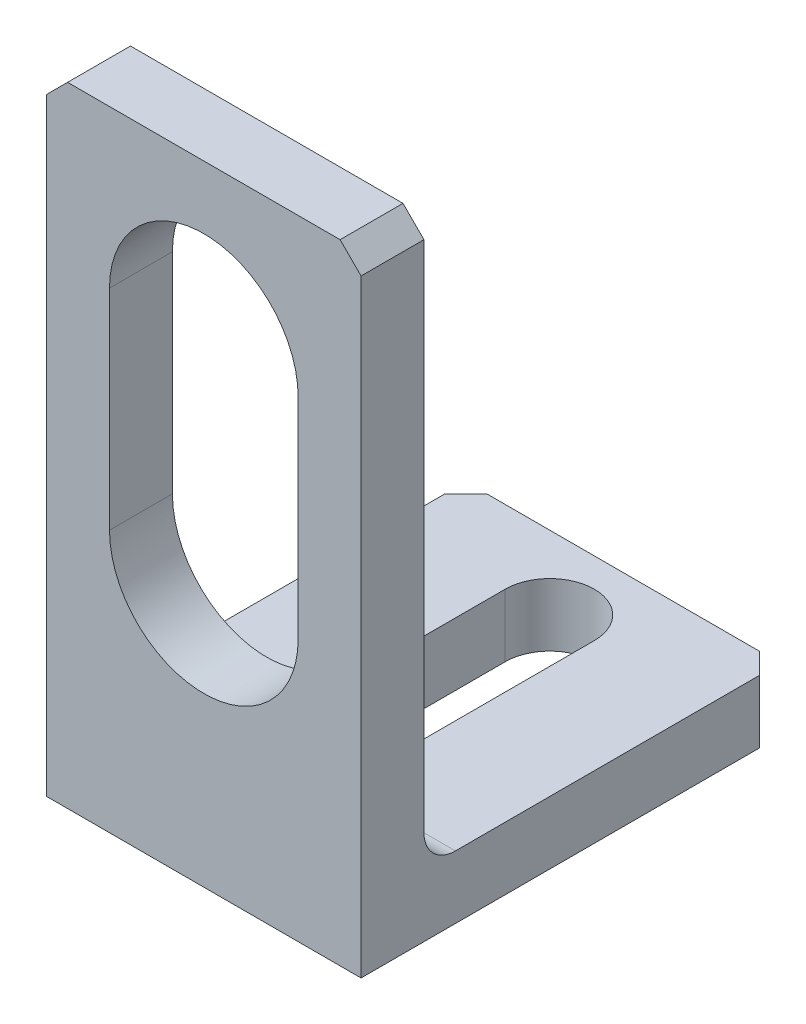
ISO-10303-21;
HEADER;
FILE_DESCRIPTION(('STEP AP214'),'2;1');
FILE_NAME('part.step','',(''),(''),'','','');
FILE_SCHEMA(('AUTOMOTIVE_DESIGN { 1 0 10303 214 1 1 1 1 }'));
ENDSEC;
DATA;
#1=APPLICATION_CONTEXT('core data for automotive mechanical design processes');
#2=APPLICATION_PROTOCOL_DEFINITION('international standard','automotive_design',2000,#1);
#3=PRODUCT_CONTEXT('',#1,'mechanical');
#4=PRODUCT('Part','Part','',(#3));
#5=PRODUCT_RELATED_PRODUCT_CATEGORY('part','',(#4));
#6=PRODUCT_DEFINITION_FORMATION('','',#4);
#7=PRODUCT_DEFINITION_CONTEXT('part definition',#1,'design');
#8=PRODUCT_DEFINITION('design','',#6,#7);
#9=PRODUCT_DEFINITION_SHAPE('','',#8);
#10=(LENGTH_UNIT() NAMED_UNIT(*) SI_UNIT(.MILLI.,.METRE.));
#11=(NAMED_UNIT(*) PLANE_ANGLE_UNIT() SI_UNIT($,.RADIAN.));
#12=(NAMED_UNIT(*) SI_UNIT($,.STERADIAN.) SOLID_ANGLE_UNIT());
#13=UNCERTAINTY_MEASURE_WITH_UNIT(LENGTH_MEASURE(1.E-05),#10,'distance_accuracy_value','');
#14=(GEOMETRIC_REPRESENTATION_CONTEXT(3) GLOBAL_UNCERTAINTY_ASSIGNED_CONTEXT((#13)) GLOBAL_UNIT_ASSIGNED_CONTEXT((#10,
#11,#12)) REPRESENTATION_CONTEXT('',''));
#15=CARTESIAN_POINT('',(0.,0.,0.));
#16=DIRECTION('',(0.,0.,1.));
#17=DIRECTION('',(1.,0.,0.));
#18=AXIS2_PLACEMENT_3D('',#15,#16,#17);
#19=CARTESIAN_POINT('',(0.,0.,-3.));
#20=DIRECTION('',(0.,0.,1.));
#21=DIRECTION('',(1.,0.,0.));
#22=AXIS2_PLACEMENT_3D('',#19,#20,#21);
#23=PLANE('',#22);
#24=CARTESIAN_POINT('',(0.,45.,-3.));
#25=DIRECTION('',(0.,0.,1.));
#26=DIRECTION('',(1.,0.,0.));
#27=AXIS2_PLACEMENT_3D('',#24,#25,#26);
#28=CIRCLE('',#27,8.99999999999999);
#29=CARTESIAN_POINT('',(8.99999999999999,45.,-3.));
#30=VERTEX_POINT('',#29);
#31=CARTESIAN_POINT('',(-9.,45.,-3.));
#32=VERTEX_POINT('',#31);
#33=EDGE_CURVE('E218',#30,#32,#28,.T.);
#34=ORIENTED_EDGE('',*,*,#33,.T.);
#35=DIRECTION('',(0.,-1.,0.));
#36=VECTOR('',#35,1.);
#37=CARTESIAN_POINT('',(-9.,45.,-3.));
#38=LINE('',#37,#36);
#39=CARTESIAN_POINT('',(-8.99999999999999,25.,-3.));
#40=VERTEX_POINT('',#39);
#41=EDGE_CURVE('E234',#32,#40,#38,.T.);
#42=ORIENTED_EDGE('',*,*,#41,.T.);
#43=CARTESIAN_POINT('',(0.,25.,-3.));
#44=DIRECTION('',(0.,0.,1.));
#45=DIRECTION('',(1.,0.,0.));
#46=AXIS2_PLACEMENT_3D('',#43,#44,#45);
#47=CIRCLE('',#46,8.99999999999999);
#48=CARTESIAN_POINT('',(9.,25.,-3.));
#49=VERTEX_POINT('',#48);
#50=EDGE_CURVE('E237',#40,#49,#47,.T.);
#51=ORIENTED_EDGE('',*,*,#50,.T.);
#52=DIRECTION('',(0.,1.,0.));
#53=VECTOR('',#52,1.);
#54=CARTESIAN_POINT('',(8.99999999999999,45.,-3.));
#55=LINE('',#54,#53);
#56=EDGE_CURVE('E224',#49,#30,#55,.T.);
#57=ORIENTED_EDGE('',*,*,#56,.T.);
#58=EDGE_LOOP('',(#34,#42,#51,#57));
#59=FACE_BOUND('',#58,.T.);
#60=DIRECTION('',(-1.,0.,0.));
#61=VECTOR('',#60,1.);
#62=CARTESIAN_POINT('',(-15.0000000000001,60.,-3.));
#63=LINE('',#62,#61);
#64=CARTESIAN_POINT('',(12.9999999999999,60.,-3.));
#65=VERTEX_POINT('',#64);
#66=CARTESIAN_POINT('',(-13.0000000000001,60.,-3.));
#67=VERTEX_POINT('',#66);
#68=EDGE_CURVE('E264',#65,#67,#63,.T.);
#69=ORIENTED_EDGE('',*,*,#68,.F.);
#70=DIRECTION('',(-0.707106781186546,0.707106781186549,0.));
#71=VECTOR('',#70,1.);
#72=CARTESIAN_POINT('',(12.9999999999999,60.,-3.));
#73=LINE('',#72,#71);
#74=CARTESIAN_POINT('',(14.9999999999999,58.,-3.));
#75=VERTEX_POINT('',#74);
#76=EDGE_CURVE('E312',#65,#75,#73,.F.);
#77=ORIENTED_EDGE('',*,*,#76,.T.);
#78=DIRECTION('',(0.,1.,0.));
#79=VECTOR('',#78,1.);
#80=CARTESIAN_POINT('',(14.9999999999999,60.,-3.));
#81=LINE('',#80,#79);
#82=CARTESIAN_POINT('',(14.9999999999999,9.,-3.));
#83=VERTEX_POINT('',#82);
#84=EDGE_CURVE('E251',#83,#75,#81,.T.);
#85=ORIENTED_EDGE('',*,*,#84,.F.);
#86=DIRECTION('',(1.,0.,0.));
#87=VECTOR('',#86,1.);
#88=CARTESIAN_POINT('',(-15.0000000000001,9.,-3.));
#89=LINE('',#88,#87);
#90=CARTESIAN_POINT('',(-15.0000000000001,9.,-3.));
#91=VERTEX_POINT('',#90);
#92=EDGE_CURVE('E275',#83,#91,#89,.F.);
#93=ORIENTED_EDGE('',*,*,#92,.T.);
#94=DIRECTION('',(0.,-1.,0.));
#95=VECTOR('',#94,1.);
#96=CARTESIAN_POINT('',(-15.0000000000001,60.,-3.));
#97=LINE('',#96,#95);
#98=CARTESIAN_POINT('',(-15.0000000000001,58.,-3.));
#99=VERTEX_POINT('',#98);
#100=EDGE_CURVE('E255',#99,#91,#97,.T.);
#101=ORIENTED_EDGE('',*,*,#100,.F.);
#102=DIRECTION('',(-0.70710678118655,-0.707106781186545,0.));
#103=VECTOR('',#102,1.);
#104=CARTESIAN_POINT('',(-15.0000000000001,58.,-3.));
#105=LINE('',#104,#103);
#106=EDGE_CURVE('E310',#99,#67,#105,.F.);
#107=ORIENTED_EDGE('',*,*,#106,.T.);
#108=EDGE_LOOP('',(#69,#77,#85,#93,#101,#107));
#109=FACE_BOUND('',#108,.T.);
#110=ADVANCED_FACE('F35',(#59,#109),#23,.F.);
#111=CARTESIAN_POINT('',(0.,0.,3.));
#112=DIRECTION('',(0.,0.,1.));
#113=DIRECTION('',(1.,0.,0.));
#114=AXIS2_PLACEMENT_3D('',#111,#112,#113);
#115=PLANE('',#114);
#116=DIRECTION('',(0.,1.,0.));
#117=VECTOR('',#116,1.);
#118=CARTESIAN_POINT('',(14.9999999999999,60.,3.));
#119=LINE('',#118,#117);
#120=CARTESIAN_POINT('',(14.9999999999999,0.,3.));
#121=VERTEX_POINT('',#120);
#122=CARTESIAN_POINT('',(14.9999999999999,58.,3.));
#123=VERTEX_POINT('',#122);
#124=EDGE_CURVE('E252',#121,#123,#119,.T.);
#125=ORIENTED_EDGE('',*,*,#124,.T.);
#126=DIRECTION('',(0.707106781186546,-0.707106781186549,0.));
#127=VECTOR('',#126,1.);
#128=CARTESIAN_POINT('',(36.5,36.4999999999998,3.));
#129=LINE('',#128,#127);
#130=CARTESIAN_POINT('',(12.9999999999999,60.,3.));
#131=VERTEX_POINT('',#130);
#132=EDGE_CURVE('E11',#123,#131,#129,.F.);
#133=ORIENTED_EDGE('',*,*,#132,.T.);
#134=DIRECTION('',(-1.,0.,0.));
#135=VECTOR('',#134,1.);
#136=CARTESIAN_POINT('',(-15.0000000000001,60.,3.));
#137=LINE('',#136,#135);
#138=CARTESIAN_POINT('',(-13.0000000000001,60.,3.));
#139=VERTEX_POINT('',#138);
#140=EDGE_CURVE('E254',#131,#139,#137,.T.);
#141=ORIENTED_EDGE('',*,*,#140,.T.);
#142=DIRECTION('',(0.70710678118655,0.707106781186545,0.));
#143=VECTOR('',#142,1.);
#144=CARTESIAN_POINT('',(-36.5,36.5000000000003,3.));
#145=LINE('',#144,#143);
#146=CARTESIAN_POINT('',(-15.0000000000001,58.,3.));
#147=VERTEX_POINT('',#146);
#148=EDGE_CURVE('E44',#139,#147,#145,.F.);
#149=ORIENTED_EDGE('',*,*,#148,.T.);
#150=DIRECTION('',(0.,-1.,0.));
#151=VECTOR('',#150,1.);
#152=CARTESIAN_POINT('',(-15.0000000000001,60.,3.));
#153=LINE('',#152,#151);
#154=CARTESIAN_POINT('',(-15.0000000000001,0.,3.));
#155=VERTEX_POINT('',#154);
#156=EDGE_CURVE('E257',#147,#155,#153,.T.);
#157=ORIENTED_EDGE('',*,*,#156,.T.);
#158=DIRECTION('',(1.,0.,0.));
#159=VECTOR('',#158,1.);
#160=CARTESIAN_POINT('',(-15.0000000000001,0.,3.));
#161=LINE('',#160,#159);
#162=EDGE_CURVE('E259',#155,#121,#161,.T.);
#163=ORIENTED_EDGE('',*,*,#162,.T.);
#164=EDGE_LOOP('',(#125,#133,#141,#149,#157,#163));
#165=FACE_BOUND('',#164,.T.);
#166=DIRECTION('',(0.,-1.,0.));
#167=VECTOR('',#166,1.);
#168=CARTESIAN_POINT('',(-9.,45.,3.));
#169=LINE('',#168,#167);
#170=CARTESIAN_POINT('',(-9.,45.,3.));
#171=VERTEX_POINT('',#170);
#172=CARTESIAN_POINT('',(-8.99999999999999,25.,3.));
#173=VERTEX_POINT('',#172);
#174=EDGE_CURVE('E223',#171,#173,#169,.T.);
#175=ORIENTED_EDGE('',*,*,#174,.F.);
#176=CARTESIAN_POINT('',(0.,45.,3.));
#177=DIRECTION('',(0.,0.,1.));
#178=DIRECTION('',(1.,0.,0.));
#179=AXIS2_PLACEMENT_3D('',#176,#177,#178);
#180=CIRCLE('',#179,8.99999999999999);
#181=CARTESIAN_POINT('',(8.99999999999999,45.,3.));
#182=VERTEX_POINT('',#181);
#183=EDGE_CURVE('E221',#182,#171,#180,.T.);
#184=ORIENTED_EDGE('',*,*,#183,.F.);
#185=DIRECTION('',(0.,1.,0.));
#186=VECTOR('',#185,1.);
#187=CARTESIAN_POINT('',(8.99999999999999,45.,3.));
#188=LINE('',#187,#186);
#189=CARTESIAN_POINT('',(9.,25.,3.));
#190=VERTEX_POINT('',#189);
#191=EDGE_CURVE('E229',#190,#182,#188,.T.);
#192=ORIENTED_EDGE('',*,*,#191,.F.);
#193=CARTESIAN_POINT('',(0.,25.,3.));
#194=DIRECTION('',(0.,0.,1.));
#195=DIRECTION('',(1.,0.,0.));
#196=AXIS2_PLACEMENT_3D('',#193,#194,#195);
#197=CIRCLE('',#196,8.99999999999999);
#198=EDGE_CURVE('E226',#173,#190,#197,.T.);
#199=ORIENTED_EDGE('',*,*,#198,.F.);
#200=EDGE_LOOP('',(#175,#184,#192,#199));
#201=FACE_BOUND('',#200,.T.);
#202=ADVANCED_FACE('F315',(#165,#201),#115,.T.);
#203=CARTESIAN_POINT('',(14.9999999999999,60.,3.));
#204=DIRECTION('',(-1.,0.,0.));
#205=DIRECTION('',(0.,-1.,0.));
#206=AXIS2_PLACEMENT_3D('',#203,#204,#205);
#207=PLANE('',#206);
#208=DIRECTION('',(0.,0.,-1.));
#209=VECTOR('',#208,1.);
#210=CARTESIAN_POINT('',(14.9999999999999,0.,3.));
#211=LINE('',#210,#209);
#212=CARTESIAN_POINT('',(14.9999999999999,0.,-35.));
#213=VERTEX_POINT('',#212);
#214=EDGE_CURVE('E261',#121,#213,#211,.T.);
#215=ORIENTED_EDGE('',*,*,#214,.T.);
#216=DIRECTION('',(0.,1.,0.));
#217=VECTOR('',#216,1.);
#218=CARTESIAN_POINT('',(14.9999999999999,60.,-35.));
#219=LINE('',#218,#217);
#220=CARTESIAN_POINT('',(14.9999999999999,6.,-35.));
#221=VERTEX_POINT('',#220);
#222=EDGE_CURVE('E304',#213,#221,#219,.T.);
#223=ORIENTED_EDGE('',*,*,#222,.T.);
#224=DIRECTION('',(0.,0.,-1.));
#225=VECTOR('',#224,1.);
#226=CARTESIAN_POINT('',(14.9999999999999,6.,-3.));
#227=LINE('',#226,#225);
#228=CARTESIAN_POINT('',(14.9999999999999,6.,-6.));
#229=VERTEX_POINT('',#228);
#230=EDGE_CURVE('E212',#229,#221,#227,.T.);
#231=ORIENTED_EDGE('',*,*,#230,.F.);
#232=CARTESIAN_POINT('',(14.9999999999999,9.,-6.));
#233=DIRECTION('',(-1.,0.,0.));
#234=DIRECTION('',(0.,-1.,0.));
#235=AXIS2_PLACEMENT_3D('',#232,#233,#234);
#236=CIRCLE('',#235,3.);
#237=EDGE_CURVE('E278',#229,#83,#236,.T.);
#238=ORIENTED_EDGE('',*,*,#237,.T.);
#239=ORIENTED_EDGE('',*,*,#84,.T.);
#240=DIRECTION('',(0.,0.,1.));
#241=VECTOR('',#240,1.);
#242=CARTESIAN_POINT('',(14.9999999999999,58.,3.));
#243=LINE('',#242,#241);
#244=EDGE_CURVE('E302',#75,#123,#243,.T.);
#245=ORIENTED_EDGE('',*,*,#244,.T.);
#246=ORIENTED_EDGE('',*,*,#124,.F.);
#247=EDGE_LOOP('',(#215,#223,#231,#238,#239,#245,#246));
#248=FACE_BOUND('',#247,.T.);
#249=ADVANCED_FACE('F335',(#248),#207,.F.);
#250=CARTESIAN_POINT('',(-15.0000000000001,60.,3.));
#251=DIRECTION('',(0.,-1.,0.));
#252=DIRECTION('',(0.,0.,-1.));
#253=AXIS2_PLACEMENT_3D('',#250,#251,#252);
#254=PLANE('',#253);
#255=ORIENTED_EDGE('',*,*,#140,.F.);
#256=DIRECTION('',(0.,0.,-1.));
#257=VECTOR('',#256,1.);
#258=CARTESIAN_POINT('',(12.9999999999999,60.,3.));
#259=LINE('',#258,#257);
#260=EDGE_CURVE('E307',#131,#65,#259,.T.);
#261=ORIENTED_EDGE('',*,*,#260,.T.);
#262=ORIENTED_EDGE('',*,*,#68,.T.);
#263=DIRECTION('',(0.,0.,1.));
#264=VECTOR('',#263,1.);
#265=CARTESIAN_POINT('',(-13.0000000000001,60.,3.));
#266=LINE('',#265,#264);
#267=EDGE_CURVE('E51',#67,#139,#266,.T.);
#268=ORIENTED_EDGE('',*,*,#267,.T.);
#269=EDGE_LOOP('',(#255,#261,#262,#268));
#270=FACE_BOUND('',#269,.T.);
#271=ADVANCED_FACE('F327',(#270),#254,.F.);
#272=CARTESIAN_POINT('',(-15.0000000000001,60.,3.));
#273=DIRECTION('',(1.,0.,0.));
#274=DIRECTION('',(0.,1.,0.));
#275=AXIS2_PLACEMENT_3D('',#272,#273,#274);
#276=PLANE('',#275);
#277=DIRECTION('',(0.,0.,1.));
#278=VECTOR('',#277,1.);
#279=CARTESIAN_POINT('',(-15.0000000000001,6.,-3.));
#280=LINE('',#279,#278);
#281=CARTESIAN_POINT('',(-15.0000000000001,6.,-35.));
#282=VERTEX_POINT('',#281);
#283=CARTESIAN_POINT('',(-15.0000000000001,6.,-6.));
#284=VERTEX_POINT('',#283);
#285=EDGE_CURVE('E210',#282,#284,#280,.T.);
#286=ORIENTED_EDGE('',*,*,#285,.F.);
#287=DIRECTION('',(0.,-1.,0.));
#288=VECTOR('',#287,1.);
#289=CARTESIAN_POINT('',(-15.0000000000001,60.,-35.));
#290=LINE('',#289,#288);
#291=CARTESIAN_POINT('',(-15.0000000000001,0.,-35.));
#292=VERTEX_POINT('',#291);
#293=EDGE_CURVE('E286',#282,#292,#290,.T.);
#294=ORIENTED_EDGE('',*,*,#293,.T.);
#295=DIRECTION('',(0.,0.,-1.));
#296=VECTOR('',#295,1.);
#297=CARTESIAN_POINT('',(-15.0000000000001,0.,3.));
#298=LINE('',#297,#296);
#299=EDGE_CURVE('E269',#155,#292,#298,.T.);
#300=ORIENTED_EDGE('',*,*,#299,.F.);
#301=ORIENTED_EDGE('',*,*,#156,.F.);
#302=DIRECTION('',(0.,0.,-1.));
#303=VECTOR('',#302,1.);
#304=CARTESIAN_POINT('',(-15.0000000000001,58.,3.));
#305=LINE('',#304,#303);
#306=EDGE_CURVE('E283',#147,#99,#305,.T.);
#307=ORIENTED_EDGE('',*,*,#306,.T.);
#308=ORIENTED_EDGE('',*,*,#100,.T.);
#309=CARTESIAN_POINT('',(-15.0000000000001,9.,-6.));
#310=DIRECTION('',(1.,0.,0.));
#311=DIRECTION('',(0.,1.,0.));
#312=AXIS2_PLACEMENT_3D('',#309,#310,#311);
#313=CIRCLE('',#312,3.);
#314=EDGE_CURVE('E280',#91,#284,#313,.T.);
#315=ORIENTED_EDGE('',*,*,#314,.T.);
#316=EDGE_LOOP('',(#286,#294,#300,#301,#307,#308,#315));
#317=FACE_BOUND('',#316,.T.);
#318=ADVANCED_FACE('F322',(#317),#276,.F.);
#319=CARTESIAN_POINT('',(-15.0000000000001,0.,3.));
#320=DIRECTION('',(0.,1.,0.));
#321=DIRECTION('',(0.,0.,1.));
#322=AXIS2_PLACEMENT_3D('',#319,#320,#321);
#323=PLANE('',#322);
#324=ORIENTED_EDGE('',*,*,#299,.T.);
#325=DIRECTION('',(-0.707106781186547,0.,0.707106781186548));
#326=VECTOR('',#325,1.);
#327=CARTESIAN_POINT('',(-15.0000000000001,0.,-35.));
#328=LINE('',#327,#326);
#329=CARTESIAN_POINT('',(-13.0000000000001,0.,-37.));
#330=VERTEX_POINT('',#329);
#331=EDGE_CURVE('E291',#292,#330,#328,.F.);
#332=ORIENTED_EDGE('',*,*,#331,.T.);
#333=DIRECTION('',(-1.,0.,0.));
#334=VECTOR('',#333,1.);
#335=CARTESIAN_POINT('',(-15.0000000000001,0.,-37.));
#336=LINE('',#335,#334);
#337=CARTESIAN_POINT('',(12.9999999999999,0.,-37.));
#338=VERTEX_POINT('',#337);
#339=EDGE_CURVE('E186',#338,#330,#336,.T.);
#340=ORIENTED_EDGE('',*,*,#339,.F.);
#341=DIRECTION('',(-0.707106781186546,0.,-0.707106781186549));
#342=VECTOR('',#341,1.);
#343=CARTESIAN_POINT('',(12.9999999999999,0.,-37.));
#344=LINE('',#343,#342);
#345=EDGE_CURVE('E289',#338,#213,#344,.F.);
#346=ORIENTED_EDGE('',*,*,#345,.T.);
#347=ORIENTED_EDGE('',*,*,#214,.F.);
#348=ORIENTED_EDGE('',*,*,#162,.F.);
#349=EDGE_LOOP('',(#324,#332,#340,#346,#347,#348));
#350=FACE_BOUND('',#349,.T.);
#351=DIRECTION('',(0.,0.,-1.));
#352=VECTOR('',#351,1.);
#353=CARTESIAN_POINT('',(4.25,0.,-30.));
#354=LINE('',#353,#352);
#355=CARTESIAN_POINT('',(4.25,0.,-12.));
#356=VERTEX_POINT('',#355);
#357=CARTESIAN_POINT('',(4.25,0.,-30.));
#358=VERTEX_POINT('',#357);
#359=EDGE_CURVE('E179',#356,#358,#354,.T.);
#360=ORIENTED_EDGE('',*,*,#359,.T.);
#361=CARTESIAN_POINT('',(0.,0.,-30.));
#362=DIRECTION('',(0.,1.,0.));
#363=DIRECTION('',(0.,0.,1.));
#364=AXIS2_PLACEMENT_3D('',#361,#362,#363);
#365=CIRCLE('',#364,4.25);
#366=CARTESIAN_POINT('',(-4.25,0.,-30.));
#367=VERTEX_POINT('',#366);
#368=EDGE_CURVE('E198',#358,#367,#365,.T.);
#369=ORIENTED_EDGE('',*,*,#368,.T.);
#370=DIRECTION('',(0.,0.,1.));
#371=VECTOR('',#370,1.);
#372=CARTESIAN_POINT('',(-4.25,0.,-30.));
#373=LINE('',#372,#371);
#374=CARTESIAN_POINT('',(-4.25,0.,-12.));
#375=VERTEX_POINT('',#374);
#376=EDGE_CURVE('E185',#367,#375,#373,.T.);
#377=ORIENTED_EDGE('',*,*,#376,.T.);
#378=CARTESIAN_POINT('',(0.,0.,-12.));
#379=DIRECTION('',(0.,1.,0.));
#380=DIRECTION('',(0.,0.,1.));
#381=AXIS2_PLACEMENT_3D('',#378,#379,#380);
#382=CIRCLE('',#381,4.25);
#383=EDGE_CURVE('E201',#375,#356,#382,.T.);
#384=ORIENTED_EDGE('',*,*,#383,.T.);
#385=EDGE_LOOP('',(#360,#369,#377,#384));
#386=FACE_BOUND('',#385,.T.);
#387=ADVANCED_FACE('F351',(#350,#386),#323,.F.);
#388=CARTESIAN_POINT('',(0.,45.,3.));
#389=DIRECTION('',(0.,0.,-1.));
#390=DIRECTION('',(-1.,0.,0.));
#391=AXIS2_PLACEMENT_3D('',#388,#389,#390);
#392=CYLINDRICAL_SURFACE('',#391,8.99999999999999);
#393=ORIENTED_EDGE('',*,*,#33,.F.);
#394=DIRECTION('',(0.,0.,-1.));
#395=VECTOR('',#394,1.);
#396=CARTESIAN_POINT('',(8.99999999999999,45.,3.));
#397=LINE('',#396,#395);
#398=EDGE_CURVE('E231',#182,#30,#397,.T.);
#399=ORIENTED_EDGE('',*,*,#398,.F.);
#400=ORIENTED_EDGE('',*,*,#183,.T.);
#401=DIRECTION('',(0.,0.,-1.));
#402=VECTOR('',#401,1.);
#403=CARTESIAN_POINT('',(-9.,45.,3.));
#404=LINE('',#403,#402);
#405=EDGE_CURVE('E248',#171,#32,#404,.T.);
#406=ORIENTED_EDGE('',*,*,#405,.T.);
#407=EDGE_LOOP('',(#393,#399,#400,#406));
#408=FACE_BOUND('',#407,.T.);
#409=ADVANCED_FACE('F380',(#408),#392,.F.);
#410=CARTESIAN_POINT('',(-9.,45.,3.));
#411=DIRECTION('',(1.,0.,0.));
#412=DIRECTION('',(0.,1.,0.));
#413=AXIS2_PLACEMENT_3D('',#410,#411,#412);
#414=PLANE('',#413);
#415=ORIENTED_EDGE('',*,*,#41,.F.);
#416=ORIENTED_EDGE('',*,*,#405,.F.);
#417=ORIENTED_EDGE('',*,*,#174,.T.);
#418=DIRECTION('',(0.,0.,-1.));
#419=VECTOR('',#418,1.);
#420=CARTESIAN_POINT('',(-8.99999999999999,25.,3.));
#421=LINE('',#420,#419);
#422=EDGE_CURVE('E246',#173,#40,#421,.T.);
#423=ORIENTED_EDGE('',*,*,#422,.T.);
#424=EDGE_LOOP('',(#415,#416,#417,#423));
#425=FACE_BOUND('',#424,.T.);
#426=ADVANCED_FACE('F427',(#425),#414,.T.);
#427=CARTESIAN_POINT('',(0.,25.,3.));
#428=DIRECTION('',(0.,0.,-1.));
#429=DIRECTION('',(-1.,0.,0.));
#430=AXIS2_PLACEMENT_3D('',#427,#428,#429);
#431=CYLINDRICAL_SURFACE('',#430,8.99999999999999);
#432=ORIENTED_EDGE('',*,*,#50,.F.);
#433=ORIENTED_EDGE('',*,*,#422,.F.);
#434=ORIENTED_EDGE('',*,*,#198,.T.);
#435=DIRECTION('',(0.,0.,-1.));
#436=VECTOR('',#435,1.);
#437=CARTESIAN_POINT('',(9.,25.,3.));
#438=LINE('',#437,#436);
#439=EDGE_CURVE('E244',#190,#49,#438,.T.);
#440=ORIENTED_EDGE('',*,*,#439,.T.);
#441=EDGE_LOOP('',(#432,#433,#434,#440));
#442=FACE_BOUND('',#441,.T.);
#443=ADVANCED_FACE('F423',(#442),#431,.F.);
#444=CARTESIAN_POINT('',(8.99999999999999,45.,3.));
#445=DIRECTION('',(-1.,0.,0.));
#446=DIRECTION('',(0.,-1.,0.));
#447=AXIS2_PLACEMENT_3D('',#444,#445,#446);
#448=PLANE('',#447);
#449=ORIENTED_EDGE('',*,*,#56,.F.);
#450=ORIENTED_EDGE('',*,*,#439,.F.);
#451=ORIENTED_EDGE('',*,*,#191,.T.);
#452=ORIENTED_EDGE('',*,*,#398,.T.);
#453=EDGE_LOOP('',(#449,#450,#451,#452));
#454=FACE_BOUND('',#453,.T.);
#455=ADVANCED_FACE('F418',(#454),#448,.T.);
#456=CARTESIAN_POINT('',(0.,6.,0.));
#457=DIRECTION('',(0.,-1.,0.));
#458=DIRECTION('',(0.,0.,-1.));
#459=AXIS2_PLACEMENT_3D('',#456,#457,#458);
#460=PLANE('',#459);
#461=DIRECTION('',(-1.,0.,0.));
#462=VECTOR('',#461,1.);
#463=CARTESIAN_POINT('',(-15.0000000000001,6.,-37.));
#464=LINE('',#463,#462);
#465=CARTESIAN_POINT('',(12.9999999999999,6.,-37.));
#466=VERTEX_POINT('',#465);
#467=CARTESIAN_POINT('',(-13.0000000000001,6.,-37.));
#468=VERTEX_POINT('',#467);
#469=EDGE_CURVE('E215',#466,#468,#464,.T.);
#470=ORIENTED_EDGE('',*,*,#469,.T.);
#471=DIRECTION('',(0.707106781186547,0.,-0.707106781186548));
#472=VECTOR('',#471,1.);
#473=CARTESIAN_POINT('',(-15.0000000000001,6.,-35.));
#474=LINE('',#473,#472);
#475=EDGE_CURVE('E300',#468,#282,#474,.F.);
#476=ORIENTED_EDGE('',*,*,#475,.T.);
#477=ORIENTED_EDGE('',*,*,#285,.T.);
#478=DIRECTION('',(1.,0.,0.));
#479=VECTOR('',#478,1.);
#480=CARTESIAN_POINT('',(14.9999999999999,6.,-6.));
#481=LINE('',#480,#479);
#482=EDGE_CURVE('E272',#284,#229,#481,.T.);
#483=ORIENTED_EDGE('',*,*,#482,.T.);
#484=ORIENTED_EDGE('',*,*,#230,.T.);
#485=DIRECTION('',(0.707106781186546,0.,0.707106781186549));
#486=VECTOR('',#485,1.);
#487=CARTESIAN_POINT('',(12.9999999999999,6.00000000000001,-37.));
#488=LINE('',#487,#486);
#489=EDGE_CURVE('E298',#221,#466,#488,.F.);
#490=ORIENTED_EDGE('',*,*,#489,.T.);
#491=EDGE_LOOP('',(#470,#476,#477,#483,#484,#490));
#492=FACE_BOUND('',#491,.T.);
#493=CARTESIAN_POINT('',(0.,6.,-30.));
#494=DIRECTION('',(0.,1.,0.));
#495=DIRECTION('',(0.,0.,1.));
#496=AXIS2_PLACEMENT_3D('',#493,#494,#495);
#497=CIRCLE('',#496,4.25);
#498=CARTESIAN_POINT('',(4.25,6.,-30.));
#499=VERTEX_POINT('',#498);
#500=CARTESIAN_POINT('',(-4.25,6.,-30.));
#501=VERTEX_POINT('',#500);
#502=EDGE_CURVE('E168',#499,#501,#497,.T.);
#503=ORIENTED_EDGE('',*,*,#502,.F.);
#504=DIRECTION('',(0.,0.,-1.));
#505=VECTOR('',#504,1.);
#506=CARTESIAN_POINT('',(4.25,6.,-30.));
#507=LINE('',#506,#505);
#508=CARTESIAN_POINT('',(4.25,6.,-12.));
#509=VERTEX_POINT('',#508);
#510=EDGE_CURVE('E194',#509,#499,#507,.T.);
#511=ORIENTED_EDGE('',*,*,#510,.F.);
#512=CARTESIAN_POINT('',(0.,6.,-12.));
#513=DIRECTION('',(0.,1.,0.));
#514=DIRECTION('',(0.,0.,1.));
#515=AXIS2_PLACEMENT_3D('',#512,#513,#514);
#516=CIRCLE('',#515,4.25);
#517=CARTESIAN_POINT('',(-4.25,6.,-12.));
#518=VERTEX_POINT('',#517);
#519=EDGE_CURVE('E192',#518,#509,#516,.T.);
#520=ORIENTED_EDGE('',*,*,#519,.F.);
#521=DIRECTION('',(0.,0.,1.));
#522=VECTOR('',#521,1.);
#523=CARTESIAN_POINT('',(-4.25,6.,-30.));
#524=LINE('',#523,#522);
#525=EDGE_CURVE('E178',#501,#518,#524,.T.);
#526=ORIENTED_EDGE('',*,*,#525,.F.);
#527=EDGE_LOOP('',(#503,#511,#520,#526));
#528=FACE_BOUND('',#527,.T.);
#529=ADVANCED_FACE('F190',(#492,#528),#460,.F.);
#530=CARTESIAN_POINT('',(-15.0000000000001,6.,-37.));
#531=DIRECTION('',(0.,0.,1.));
#532=DIRECTION('',(1.,0.,0.));
#533=AXIS2_PLACEMENT_3D('',#530,#531,#532);
#534=PLANE('',#533);
#535=ORIENTED_EDGE('',*,*,#339,.T.);
#536=DIRECTION('',(0.,1.,0.));
#537=VECTOR('',#536,1.);
#538=CARTESIAN_POINT('',(-13.0000000000001,6.,-37.));
#539=LINE('',#538,#537);
#540=EDGE_CURVE('E296',#330,#468,#539,.T.);
#541=ORIENTED_EDGE('',*,*,#540,.T.);
#542=ORIENTED_EDGE('',*,*,#469,.F.);
#543=DIRECTION('',(0.,-1.,0.));
#544=VECTOR('',#543,1.);
#545=CARTESIAN_POINT('',(12.9999999999999,6.00000000000001,-37.));
#546=LINE('',#545,#544);
#547=EDGE_CURVE('E293',#466,#338,#546,.T.);
#548=ORIENTED_EDGE('',*,*,#547,.T.);
#549=EDGE_LOOP('',(#535,#541,#542,#548));
#550=FACE_BOUND('',#549,.T.);
#551=ADVANCED_FACE('F354',(#550),#534,.F.);
#552=CARTESIAN_POINT('',(0.,6.,-30.));
#553=DIRECTION('',(0.,-1.,0.));
#554=DIRECTION('',(0.,0.,-1.));
#555=AXIS2_PLACEMENT_3D('',#552,#553,#554);
#556=CYLINDRICAL_SURFACE('',#555,4.25);
#557=ORIENTED_EDGE('',*,*,#368,.F.);
#558=DIRECTION('',(0.,-1.,0.));
#559=VECTOR('',#558,1.);
#560=CARTESIAN_POINT('',(4.25,6.,-30.));
#561=LINE('',#560,#559);
#562=EDGE_CURVE('E174',#499,#358,#561,.T.);
#563=ORIENTED_EDGE('',*,*,#562,.F.);
#564=ORIENTED_EDGE('',*,*,#502,.T.);
#565=DIRECTION('',(0.,-1.,0.));
#566=VECTOR('',#565,1.);
#567=CARTESIAN_POINT('',(-4.25,6.,-30.));
#568=LINE('',#567,#566);
#569=EDGE_CURVE('E171',#501,#367,#568,.T.);
#570=ORIENTED_EDGE('',*,*,#569,.T.);
#571=EDGE_LOOP('',(#557,#563,#564,#570));
#572=FACE_BOUND('',#571,.T.);
#573=ADVANCED_FACE('F170',(#572),#556,.F.);
#574=CARTESIAN_POINT('',(-4.25,6.,-30.));
#575=DIRECTION('',(1.,0.,0.));
#576=DIRECTION('',(0.,0.,-1.));
#577=AXIS2_PLACEMENT_3D('',#574,#575,#576);
#578=PLANE('',#577);
#579=ORIENTED_EDGE('',*,*,#376,.F.);
#580=ORIENTED_EDGE('',*,*,#569,.F.);
#581=ORIENTED_EDGE('',*,*,#525,.T.);
#582=DIRECTION('',(0.,-1.,0.));
#583=VECTOR('',#582,1.);
#584=CARTESIAN_POINT('',(-4.25,6.,-12.));
#585=LINE('',#584,#583);
#586=EDGE_CURVE('E187',#518,#375,#585,.T.);
#587=ORIENTED_EDGE('',*,*,#586,.T.);
#588=EDGE_LOOP('',(#579,#580,#581,#587));
#589=FACE_BOUND('',#588,.T.);
#590=ADVANCED_FACE('F182',(#589),#578,.T.);
#591=CARTESIAN_POINT('',(0.,6.,-12.));
#592=DIRECTION('',(0.,-1.,0.));
#593=DIRECTION('',(0.,0.,-1.));
#594=AXIS2_PLACEMENT_3D('',#591,#592,#593);
#595=CYLINDRICAL_SURFACE('',#594,4.25);
#596=ORIENTED_EDGE('',*,*,#383,.F.);
#597=ORIENTED_EDGE('',*,*,#586,.F.);
#598=ORIENTED_EDGE('',*,*,#519,.T.);
#599=DIRECTION('',(0.,-1.,0.));
#600=VECTOR('',#599,1.);
#601=CARTESIAN_POINT('',(4.25,6.,-12.));
#602=LINE('',#601,#600);
#603=EDGE_CURVE('E207',#509,#356,#602,.T.);
#604=ORIENTED_EDGE('',*,*,#603,.T.);
#605=EDGE_LOOP('',(#596,#597,#598,#604));
#606=FACE_BOUND('',#605,.T.);
#607=ADVANCED_FACE('F402',(#606),#595,.F.);
#608=CARTESIAN_POINT('',(4.25,6.,-30.));
#609=DIRECTION('',(-1.,0.,0.));
#610=DIRECTION('',(0.,0.,1.));
#611=AXIS2_PLACEMENT_3D('',#608,#609,#610);
#612=PLANE('',#611);
#613=ORIENTED_EDGE('',*,*,#359,.F.);
#614=ORIENTED_EDGE('',*,*,#603,.F.);
#615=ORIENTED_EDGE('',*,*,#510,.T.);
#616=ORIENTED_EDGE('',*,*,#562,.T.);
#617=EDGE_LOOP('',(#613,#614,#615,#616));
#618=FACE_BOUND('',#617,.T.);
#619=ADVANCED_FACE('F388',(#618),#612,.T.);
#620=CARTESIAN_POINT('',(0.,9.,-6.));
#621=DIRECTION('',(-1.,0.,0.));
#622=DIRECTION('',(0.,0.,1.));
#623=AXIS2_PLACEMENT_3D('',#620,#621,#622);
#624=CYLINDRICAL_SURFACE('',#623,3.);
#625=ORIENTED_EDGE('',*,*,#314,.F.);
#626=ORIENTED_EDGE('',*,*,#92,.F.);
#627=ORIENTED_EDGE('',*,*,#237,.F.);
#628=ORIENTED_EDGE('',*,*,#482,.F.);
#629=EDGE_LOOP('',(#625,#626,#627,#628));
#630=FACE_BOUND('',#629,.T.);
#631=ADVANCED_FACE('F341',(#630),#624,.F.);
#632=CARTESIAN_POINT('',(-15.0000000000001,60.,-35.));
#633=DIRECTION('',(0.707106781186548,0.,0.707106781186547));
#634=DIRECTION('',(0.,-1.,0.));
#635=AXIS2_PLACEMENT_3D('',#632,#633,#634);
#636=PLANE('',#635);
#637=ORIENTED_EDGE('',*,*,#475,.F.);
#638=ORIENTED_EDGE('',*,*,#540,.F.);
#639=ORIENTED_EDGE('',*,*,#331,.F.);
#640=ORIENTED_EDGE('',*,*,#293,.F.);
#641=EDGE_LOOP('',(#637,#638,#639,#640));
#642=FACE_BOUND('',#641,.T.);
#643=ADVANCED_FACE('F347',(#642),#636,.F.);
#644=CARTESIAN_POINT('',(12.9999999999999,6.00000000000001,-37.));
#645=DIRECTION('',(-0.707106781186549,0.,0.707106781186546));
#646=DIRECTION('',(0.,-1.,0.));
#647=AXIS2_PLACEMENT_3D('',#644,#645,#646);
#648=PLANE('',#647);
#649=ORIENTED_EDGE('',*,*,#489,.F.);
#650=ORIENTED_EDGE('',*,*,#222,.F.);
#651=ORIENTED_EDGE('',*,*,#345,.F.);
#652=ORIENTED_EDGE('',*,*,#547,.F.);
#653=EDGE_LOOP('',(#649,#650,#651,#652));
#654=FACE_BOUND('',#653,.T.);
#655=ADVANCED_FACE('F358',(#654),#648,.F.);
#656=CARTESIAN_POINT('',(12.9999999999999,60.,3.));
#657=DIRECTION('',(-0.707106781186549,-0.707106781186546,0.));
#658=DIRECTION('',(0.,0.,-1.));
#659=AXIS2_PLACEMENT_3D('',#656,#657,#658);
#660=PLANE('',#659);
#661=ORIENTED_EDGE('',*,*,#132,.F.);
#662=ORIENTED_EDGE('',*,*,#244,.F.);
#663=ORIENTED_EDGE('',*,*,#76,.F.);
#664=ORIENTED_EDGE('',*,*,#260,.F.);
#665=EDGE_LOOP('',(#661,#662,#663,#664));
#666=FACE_BOUND('',#665,.T.);
#667=ADVANCED_FACE('F330',(#666),#660,.F.);
#668=CARTESIAN_POINT('',(-15.0000000000001,58.,3.));
#669=DIRECTION('',(0.707106781186545,-0.70710678118655,0.));
#670=DIRECTION('',(0.,0.,-1.));
#671=AXIS2_PLACEMENT_3D('',#668,#669,#670);
#672=PLANE('',#671);
#673=ORIENTED_EDGE('',*,*,#148,.F.);
#674=ORIENTED_EDGE('',*,*,#267,.F.);
#675=ORIENTED_EDGE('',*,*,#106,.F.);
#676=ORIENTED_EDGE('',*,*,#306,.F.);
#677=EDGE_LOOP('',(#673,#674,#675,#676));
#678=FACE_BOUND('',#677,.T.);
#679=ADVANCED_FACE('F38',(#678),#672,.F.);
#680=CLOSED_SHELL('',(#110,#202,#249,#271,#318,#387,#409,#426,#443,#455,#529,#551,#573,#590,
#607,#619,#631,#643,#655,#667,#679));
#681=MANIFOLD_SOLID_BREP('B2',#680);
#682=ADVANCED_BREP_SHAPE_REPRESENTATION('',(#18,#681),#14);
#683=SHAPE_DEFINITION_REPRESENTATION(#9,#682);
ENDSEC;
END-ISO-10303-21;
